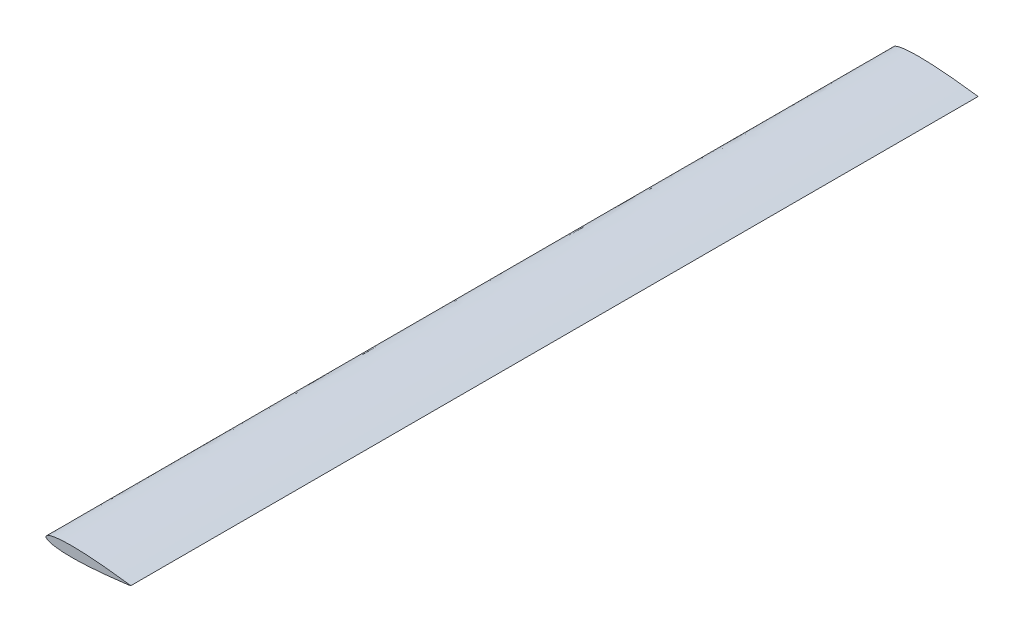
ISO-10303-21;
HEADER;
FILE_DESCRIPTION(('STEP AP214'),'2;1');
FILE_NAME('part.step','',(''),(''),'','','');
FILE_SCHEMA(('AUTOMOTIVE_DESIGN { 1 0 10303 214 1 1 1 1 }'));
ENDSEC;
DATA;
#1=APPLICATION_CONTEXT('core data for automotive mechanical design processes');
#2=APPLICATION_PROTOCOL_DEFINITION('international standard','automotive_design',2000,#1);
#3=PRODUCT_CONTEXT('',#1,'mechanical');
#4=PRODUCT('Part','Part','',(#3));
#5=PRODUCT_RELATED_PRODUCT_CATEGORY('part','',(#4));
#6=PRODUCT_DEFINITION_FORMATION('','',#4);
#7=PRODUCT_DEFINITION_CONTEXT('part definition',#1,'design');
#8=PRODUCT_DEFINITION('design','',#6,#7);
#9=PRODUCT_DEFINITION_SHAPE('','',#8);
#10=(LENGTH_UNIT() NAMED_UNIT(*) SI_UNIT(.MILLI.,.METRE.));
#11=(NAMED_UNIT(*) PLANE_ANGLE_UNIT() SI_UNIT($,.RADIAN.));
#12=(NAMED_UNIT(*) SI_UNIT($,.STERADIAN.) SOLID_ANGLE_UNIT());
#13=UNCERTAINTY_MEASURE_WITH_UNIT(LENGTH_MEASURE(1.E-05),#10,'distance_accuracy_value','');
#14=(GEOMETRIC_REPRESENTATION_CONTEXT(3) GLOBAL_UNCERTAINTY_ASSIGNED_CONTEXT((#13)) GLOBAL_UNIT_ASSIGNED_CONTEXT((#10,
#11,#12)) REPRESENTATION_CONTEXT('',''));
#15=CARTESIAN_POINT('',(0.,0.,0.));
#16=DIRECTION('',(0.,0.,1.));
#17=DIRECTION('',(1.,0.,0.));
#18=AXIS2_PLACEMENT_3D('',#15,#16,#17);
#19=CARTESIAN_POINT('',(0.,0.,10000.));
#20=CARTESIAN_POINT('',(-0.000792795405070369,-1.43720901794934,10000.));
#21=CARTESIAN_POINT('',(0.409444502492352,-4.38572469884501,10000.));
#22=CARTESIAN_POINT('',(2.25434713910245,-8.66028941048438,10000.));
#23=CARTESIAN_POINT('',(5.27074447818927,-12.7749518937072,10000.));
#24=CARTESIAN_POINT('',(9.42198257854812,-16.7475433871662,10000.));
#25=CARTESIAN_POINT('',(14.694615069678,-20.592001802784,10000.));
#26=CARTESIAN_POINT('',(21.0809596129229,-24.3119933407106,10000.));
#27=CARTESIAN_POINT('',(28.5716690543542,-27.9032902367736,10000.));
#28=CARTESIAN_POINT('',(37.1534631968142,-31.3577538271621,10000.));
#29=CARTESIAN_POINT('',(46.809318667321,-34.6651065414147,10000.));
#30=CARTESIAN_POINT('',(57.5186285304887,-37.8142745421539,10000.));
#31=CARTESIAN_POINT('',(69.2578261920979,-40.7934025621558,10000.));
#32=CARTESIAN_POINT('',(82.0002665891502,-43.5916843372624,10000.));
#33=CARTESIAN_POINT('',(95.7169555064091,-46.197637409165,10000.));
#34=CARTESIAN_POINT('',(110.376185726059,-48.601790331793,10000.));
#35=CARTESIAN_POINT('',(125.944126705451,-50.7942910336428,10000.));
#36=CARTESIAN_POINT('',(142.384569591742,-52.7677467681917,10000.));
#37=CARTESIAN_POINT('',(159.659307757944,-54.5151196644264,10000.));
#38=CARTESIAN_POINT('',(177.728060470773,-56.031551969668,10000.));
#39=CARTESIAN_POINT('',(196.548725497869,-57.3135357868012,10000.));
#40=CARTESIAN_POINT('',(216.077457601565,-58.358911955557,10000.));
#41=CARTESIAN_POINT('',(236.268658255214,-59.1678864812133,10000.));
#42=CARTESIAN_POINT('',(257.075184120231,-59.7419248488066,10000.));
#43=CARTESIAN_POINT('',(278.448476323679,-60.0840743315553,10000.));
#44=CARTESIAN_POINT('',(300.33866592988,-60.1994214936438,10000.));
#45=CARTESIAN_POINT('',(322.694622735347,-60.094113531422,10000.));
#46=CARTESIAN_POINT('',(345.464143189067,-59.7758146565333,10000.));
#47=CARTESIAN_POINT('',(368.594056668677,-59.2534604904865,10000.));
#48=CARTESIAN_POINT('',(392.030398993101,-58.5371931930983,10000.));
#49=CARTESIAN_POINT('',(415.71842585286,-57.6376330673979,10000.));
#50=CARTESIAN_POINT('',(439.602801494764,-56.5664908875375,10000.));
#51=CARTESIAN_POINT('',(463.627758769047,-55.3360431136563,10000.));
#52=CARTESIAN_POINT('',(487.737220494169,-53.9587882758612,10000.));
#53=CARTESIAN_POINT('',(511.87488318647,-52.4476138881414,10000.));
#54=CARTESIAN_POINT('',(535.984371375202,-50.8154517556381,10000.));
#55=CARTESIAN_POINT('',(560.009401700888,-49.0751900854433,10000.));
#56=CARTESIAN_POINT('',(583.893850790625,-47.2399418548301,10000.));
#57=CARTESIAN_POINT('',(607.581947996892,-45.3220450125794,10000.));
#58=CARTESIAN_POINT('',(631.018326919359,-43.3340828258684,10000.));
#59=CARTESIAN_POINT('',(654.148334193681,-41.2881522133876,10000.));
#60=CARTESIAN_POINT('',(676.917878388777,-39.1960613852951,10000.));
#61=CARTESIAN_POINT('',(699.27383310457,-37.0695918537327,10000.));
#62=CARTESIAN_POINT('',(721.163907940674,-34.919598689816,10000.));
#63=CARTESIAN_POINT('',(742.537076407175,-32.7572838564758,10000.));
#64=CARTESIAN_POINT('',(763.343326049556,-30.5931903526168,10000.));
#65=CARTESIAN_POINT('',(783.534112501466,-28.4379889821838,10000.));
#66=CARTESIAN_POINT('',(803.062234714203,-26.3021924537498,10000.));
#67=CARTESIAN_POINT('',(821.882065187473,-24.1953936026434,10000.));
#68=CARTESIAN_POINT('',(839.949720905107,-22.1283263387876,10000.));
#69=CARTESIAN_POINT('',(857.22296601622,-20.1106260619716,10000.));
#70=CARTESIAN_POINT('',(873.66145334122,-18.1522308617084,10000.));
#71=CARTESIAN_POINT('',(889.226740486499,-16.2628126143087,10000.));
#72=CARTESIAN_POINT('',(903.882537267435,-14.4523042324679,10000.));
#73=CARTESIAN_POINT('',(917.594569234184,-12.7298421068495,10000.));
#74=CARTESIAN_POINT('',(930.330846082998,-11.1051297885539,10000.));
#75=CARTESIAN_POINT('',(942.061526717181,-9.58639472895522,10000.));
#76=CARTESIAN_POINT('',(952.759379700056,-8.18339780379396,10000.));
#77=CARTESIAN_POINT('',(962.39909337424,-6.90239112392789,10000.));
#78=CARTESIAN_POINT('',(970.959106116575,-5.75556350979757,10000.));
#79=CARTESIAN_POINT('',(978.416539655893,-4.73704782658936,10000.));
#80=CARTESIAN_POINT('',(984.762543681692,-3.8910735599893,10000.));
#81=CARTESIAN_POINT('',(989.957865656706,-3.11547500184581,10000.));
#82=CARTESIAN_POINT('',(994.055890001684,-2.70308641650711,10000.));
#83=CARTESIAN_POINT('',(996.887787519083,-1.95719904266136,10000.));
#84=CARTESIAN_POINT('',(999.511557869285,-2.45214101406822,10000.));
#85=CARTESIAN_POINT('',(1000.48876725043,0.770740832716149,10000.));
#86=CARTESIAN_POINT('',(998.63732483532,0.784296204766219,10000.));
#87=CARTESIAN_POINT('',(996.976919865702,1.12960195222023,10000.));
#88=CARTESIAN_POINT('',(994.017909109704,1.48095984259178,10000.));
#89=CARTESIAN_POINT('',(989.9767430353,2.07317290877461,10000.));
#90=CARTESIAN_POINT('',(984.760381508977,2.78643866962468,10000.));
#91=CARTESIAN_POINT('',(978.423191435374,3.66389600305021,10000.));
#92=CARTESIAN_POINT('',(970.964194548596,4.6822725977774,10000.));
#93=CARTESIAN_POINT('',(962.406338582473,5.84129817826697,10000.));
#94=CARTESIAN_POINT('',(952.767760231741,7.13205690869354,10000.));
#95=CARTESIAN_POINT('',(942.071550495338,8.54713159362679,10000.));
#96=CARTESIAN_POINT('',(930.342525186815,10.0787225183276,10000.));
#97=CARTESIAN_POINT('',(917.608056829737,11.7175108151701,10000.));
#98=CARTESIAN_POINT('',(903.897931020654,13.4550918805866,10000.));
#99=CARTESIAN_POINT('',(889.244141323412,15.2817703439458,10000.));
#100=CARTESIAN_POINT('',(873.680947922206,17.1883590611535,10000.));
#101=CARTESIAN_POINT('',(857.244631249013,19.1648889050531,10000.));
#102=CARTESIAN_POINT('',(839.973622644905,21.201644478992,10000.));
#103=CARTESIAN_POINT('',(821.908258404754,23.2886435098918,10000.));
#104=CARTESIAN_POINT('',(803.090763693649,25.416203914468,10000.));
#105=CARTESIAN_POINT('',(783.56500966749,27.5735434022859,10000.));
#106=CARTESIAN_POINT('',(763.376613213151,29.7510187980997,10000.));
#107=CARTESIAN_POINT('',(742.572763753229,31.9380653276556,10000.));
#108=CARTESIAN_POINT('',(721.201993851847,34.1239586366864,10000.));
#109=CARTESIAN_POINT('',(699.31430430166,36.2981005569972,10000.));
#110=CARTESIAN_POINT('',(676.960709203026,38.4492328378259,10000.));
#111=CARTESIAN_POINT('',(654.193486948738,40.5664427256748,10000.));
#112=CARTESIAN_POINT('',(631.065750908671,42.6378901042562,10000.));
#113=CARTESIAN_POINT('',(607.631579453666,44.6517070946242,10000.));
#114=CARTESIAN_POINT('',(583.945612568972,46.5957364895256,10000.));
#115=CARTESIAN_POINT('',(560.063202738825,48.4573339468649,10000.));
#116=CARTESIAN_POINT('',(536.040106965058,50.2240999968117,10000.));
#117=CARTESIAN_POINT('',(511.932434119619,51.8828597523725,10000.));
#118=CARTESIAN_POINT('',(487.796453308912,53.4206629200941,10000.));
#119=CARTESIAN_POINT('',(463.688525702462,54.8245155068805,10000.));
#120=CARTESIAN_POINT('',(439.664940531602,56.0814678901787,10000.));
#121=CARTESIAN_POINT('',(415.781761154839,57.1789596807486,10000.));
#122=CARTESIAN_POINT('',(392.094741144082,58.1046529012218,10000.));
#123=CARTESIAN_POINT('',(368.659203299021,58.8467757358087,10000.));
#124=CARTESIAN_POINT('',(345.529880179047,59.3946474916847,10000.));
#125=CARTESIAN_POINT('',(322.760724743132,59.7380664796177,10000.));
#126=CARTESIAN_POINT('',(300.404897723122,59.8680384234365,10000.));
#127=CARTESIAN_POINT('',(278.514594182773,59.7768415229769,10000.));
#128=CARTESIAN_POINT('',(257.14093751261,59.4582721766071,10000.));
#129=CARTESIAN_POINT('',(236.333791006243,58.9071888057003,10000.));
#130=CARTESIAN_POINT('',(216.141710145178,58.1204905666712,10000.));
#131=CARTESIAN_POINT('',(196.611836622524,57.0966599648322,10000.));
#132=CARTESIAN_POINT('',(177.789768709904,55.8354406887898,10000.));
#133=CARTESIAN_POINT('',(159.719354000379,54.3389435255618,10000.));
#134=CARTESIAN_POINT('',(142.44269857075,52.6106299211488,10000.));
#135=CARTESIAN_POINT('',(126.000088489067,50.6553131858495,10000.));
#136=CARTESIAN_POINT('',(110.429738123545,48.4799890352125,10000.));
#137=CARTESIAN_POINT('',(95.7678644609862,46.09201026411,10000.));
#138=CARTESIAN_POINT('',(82.0483088926753,43.5011916147508,10000.));
#139=CARTESIAN_POINT('',(69.3027890664377,40.7169695466859,10000.));
#140=CARTESIAN_POINT('',(57.5603118478019,37.7507945235801,10000.));
#141=CARTESIAN_POINT('',(46.8475342054818,34.6134434070447,10000.));
#142=CARTESIAN_POINT('',(37.1880357985917,31.3167454574161,10000.));
#143=CARTESIAN_POINT('',(28.6024357671074,27.8717517708816,10000.));
#144=CARTESIAN_POINT('',(21.1077688123055,24.2887211307369,10000.));
#145=CARTESIAN_POINT('',(14.7173241021823,20.5757775445594,10000.));
#146=CARTESIAN_POINT('',(9.44045344922786,16.7371384617693,10000.));
#147=CARTESIAN_POINT('',(5.28483514271469,12.7691292089642,10000.));
#148=CARTESIAN_POINT('',(2.26390016806168,8.65779704809375,10000.));
#149=CARTESIAN_POINT('',(0.414282771983219,4.38527031316399,10000.));
#150=CARTESIAN_POINT('',(0.000792795405092487,1.43720901794941,10000.));
#151=CARTESIAN_POINT('',(0.,0.,10000.));
#152=B_SPLINE_CURVE_WITH_KNOTS('',3,(#19,#20,#21,#22,#23,#24,#25,#26,#27,#28,#29,#30,#31,#32,
#33,#34,#35,#36,#37,#38,#39,#40,#41,#42,#43,#44,#45,#46,#47,#48,#49,#50,#51,#52,#53,#54,#55,#56,
#57,#58,#59,#60,#61,#62,#63,#64,#65,#66,#67,#68,#69,#70,#71,#72,#73,#74,#75,#76,#77,#78,#79,#80,
#81,#82,#83,#84,#85,#86,#87,#88,#89,#90,#91,#92,#93,#94,#95,#96,#97,#98,#99,#100,#101,#102,#103,
#104,#105,#106,#107,#108,#109,#110,#111,#112,#113,#114,#115,#116,#117,#118,#119,#120,#121,#122,
#123,#124,#125,#126,#127,#128,#129,#130,#131,#132,#133,#134,#135,#136,#137,#138,#139,#140,#141,
#142,#143,#144,#145,#146,#147,#148,#149,#150,#151),.UNSPECIFIED.,.T.,.F.,(4,1,1,1,1,1,1,1,1,1,1,
1,1,1,1,1,1,1,1,1,1,1,1,1,1,1,1,1,1,1,1,1,1,1,1,1,1,1,1,1,1,1,1,1,1,1,1,1,1,1,1,1,1,1,1,1,1,1,1,
1,1,1,1,1,1,1,1,1,1,1,1,1,1,1,1,1,1,1,1,1,1,1,1,1,1,1,1,1,1,1,1,1,1,1,1,1,1,1,1,1,1,1,1,1,1,1,1,
1,1,1,1,1,1,1,1,1,1,1,1,1,1,1,1,1,1,1,1,1,1,1,4),(0.,0.00210662516508742,0.00432152779818795,
0.00677425311619007,0.00955877103083025,0.0127368049010756,0.0163464345052028,
0.0204100326990616,0.0249395135575642,0.0299395674092772,0.0354099237879132,0.0413464010576641,
0.0477419489806625,0.0545872336441876,0.0618708296618995,0.0695796682516994,0.0776991699138581,
0.0862133904959165,0.0951050764748118,0.104355887164511,0.113946424196437,0.123856213068997,
0.134063796675122,0.144546894541679,0.155282409334504,0.166246427968084,0.177414278035603,
0.188760778293845,0.200260099514594,0.211885925549039,0.223611508550097,0.235409731798431,
0.247253273619159,0.259114617784141,0.270966020055346,0.282779814246078,0.294528420629423,
0.306184124834711,0.317719709284655,0.329108027813105,0.340322353341088,0.351336231846437,
0.36212384671707,0.372659750515408,0.382919227977957,0.392877985897231,0.402512657128013,
0.411800467049624,0.420719531879002,0.42924881084479,0.43736807936973,0.445058129420091,
0.4523007149308,0.459078673228063,0.46537585264345,0.471177198584052,0.476468953226327,
0.481238379415884,0.485474105671914,0.48916592312608,0.492304968013908,0.494883645700075,
0.496895826204119,0.498336554193845,0.499202389581317,0.500508758617526,0.500797610418683,
0.501663445806155,0.503104173795881,0.505116354299925,0.507695031986092,0.51083407687392,
0.514525894328086,0.518761620584116,0.523531046773673,0.528822801415947,0.53462414735655,
0.540921326771937,0.5476992850692,0.554941870579909,0.56263192063027,0.57075118915521,
0.579280468120998,0.588199532950376,0.597487342871987,0.607122014102769,0.617080772022043,
0.627340249484592,0.63787615328293,0.648663768153563,0.659677646658912,0.670891972186894,
0.682280290715345,0.693815875165289,0.705471579370577,0.717220185753922,0.729033979944654,
0.740885382215858,0.752746726380841,0.764590268201568,0.776388491449903,0.788114074450961,
0.799739900485406,0.811239221706155,0.822585721964397,0.833753572031916,0.844717590665496,
0.855453105458321,0.865936203324877,0.876143786931003,0.886053575803563,0.895644112835489,
0.904894923525188,0.913786609504083,0.922300830086142,0.9304203317483,0.9381291703381,
0.945412766355812,0.952258051019337,0.958653598942335,0.964590076212086,0.970060432590723,
0.975060486442436,0.979589967300938,0.983653565494797,0.987263195098924,0.99044122896917,
0.99322574688381,0.995678472201812,0.997893374834912,1.),.UNSPECIFIED.);
#153=DIRECTION('',(0.,0.,-1.));
#154=VECTOR('',#153,1.);
#155=SURFACE_OF_LINEAR_EXTRUSION('',#152,#154);
#156=CARTESIAN_POINT('',(0.,0.,10000.));
#157=VERTEX_POINT('',#156);
#158=EDGE_CURVE('E10',#157,#157,#152,.T.);
#159=ORIENTED_EDGE('',*,*,#158,.F.);
#160=EDGE_LOOP('',(#159));
#161=FACE_BOUND('',#160,.T.);
#162=CARTESIAN_POINT('',(0.,0.,0.));
#163=CARTESIAN_POINT('',(-0.000792795405070369,-1.43720901794934,0.));
#164=CARTESIAN_POINT('',(0.409444502492352,-4.38572469884501,0.));
#165=CARTESIAN_POINT('',(2.25434713910245,-8.66028941048438,0.));
#166=CARTESIAN_POINT('',(5.27074447818927,-12.7749518937072,0.));
#167=CARTESIAN_POINT('',(9.42198257854812,-16.7475433871662,0.));
#168=CARTESIAN_POINT('',(14.694615069678,-20.592001802784,0.));
#169=CARTESIAN_POINT('',(21.0809596129229,-24.3119933407106,0.));
#170=CARTESIAN_POINT('',(28.5716690543542,-27.9032902367736,0.));
#171=CARTESIAN_POINT('',(37.1534631968142,-31.3577538271621,0.));
#172=CARTESIAN_POINT('',(46.809318667321,-34.6651065414147,0.));
#173=CARTESIAN_POINT('',(57.5186285304887,-37.8142745421539,0.));
#174=CARTESIAN_POINT('',(69.2578261920979,-40.7934025621558,0.));
#175=CARTESIAN_POINT('',(82.0002665891502,-43.5916843372624,0.));
#176=CARTESIAN_POINT('',(95.7169555064091,-46.197637409165,0.));
#177=CARTESIAN_POINT('',(110.376185726059,-48.601790331793,0.));
#178=CARTESIAN_POINT('',(125.944126705451,-50.7942910336428,0.));
#179=CARTESIAN_POINT('',(142.384569591742,-52.7677467681917,0.));
#180=CARTESIAN_POINT('',(159.659307757944,-54.5151196644264,0.));
#181=CARTESIAN_POINT('',(177.728060470773,-56.031551969668,0.));
#182=CARTESIAN_POINT('',(196.548725497869,-57.3135357868012,0.));
#183=CARTESIAN_POINT('',(216.077457601565,-58.358911955557,0.));
#184=CARTESIAN_POINT('',(236.268658255214,-59.1678864812133,0.));
#185=CARTESIAN_POINT('',(257.075184120231,-59.7419248488066,0.));
#186=CARTESIAN_POINT('',(278.448476323679,-60.0840743315553,0.));
#187=CARTESIAN_POINT('',(300.33866592988,-60.1994214936438,0.));
#188=CARTESIAN_POINT('',(322.694622735347,-60.094113531422,0.));
#189=CARTESIAN_POINT('',(345.464143189067,-59.7758146565333,0.));
#190=CARTESIAN_POINT('',(368.594056668677,-59.2534604904865,0.));
#191=CARTESIAN_POINT('',(392.030398993101,-58.5371931930983,0.));
#192=CARTESIAN_POINT('',(415.71842585286,-57.6376330673979,0.));
#193=CARTESIAN_POINT('',(439.602801494764,-56.5664908875375,0.));
#194=CARTESIAN_POINT('',(463.627758769047,-55.3360431136563,0.));
#195=CARTESIAN_POINT('',(487.737220494169,-53.9587882758612,0.));
#196=CARTESIAN_POINT('',(511.87488318647,-52.4476138881414,0.));
#197=CARTESIAN_POINT('',(535.984371375202,-50.8154517556381,0.));
#198=CARTESIAN_POINT('',(560.009401700888,-49.0751900854433,0.));
#199=CARTESIAN_POINT('',(583.893850790625,-47.2399418548301,0.));
#200=CARTESIAN_POINT('',(607.581947996892,-45.3220450125794,0.));
#201=CARTESIAN_POINT('',(631.018326919359,-43.3340828258684,0.));
#202=CARTESIAN_POINT('',(654.148334193681,-41.2881522133876,0.));
#203=CARTESIAN_POINT('',(676.917878388777,-39.1960613852951,0.));
#204=CARTESIAN_POINT('',(699.27383310457,-37.0695918537327,0.));
#205=CARTESIAN_POINT('',(721.163907940674,-34.919598689816,0.));
#206=CARTESIAN_POINT('',(742.537076407175,-32.7572838564758,0.));
#207=CARTESIAN_POINT('',(763.343326049556,-30.5931903526168,0.));
#208=CARTESIAN_POINT('',(783.534112501466,-28.4379889821838,0.));
#209=CARTESIAN_POINT('',(803.062234714203,-26.3021924537498,0.));
#210=CARTESIAN_POINT('',(821.882065187473,-24.1953936026434,0.));
#211=CARTESIAN_POINT('',(839.949720905107,-22.1283263387876,0.));
#212=CARTESIAN_POINT('',(857.22296601622,-20.1106260619716,0.));
#213=CARTESIAN_POINT('',(873.66145334122,-18.1522308617084,0.));
#214=CARTESIAN_POINT('',(889.226740486499,-16.2628126143087,0.));
#215=CARTESIAN_POINT('',(903.882537267435,-14.4523042324679,0.));
#216=CARTESIAN_POINT('',(917.594569234184,-12.7298421068495,0.));
#217=CARTESIAN_POINT('',(930.330846082998,-11.1051297885539,0.));
#218=CARTESIAN_POINT('',(942.061526717181,-9.58639472895522,0.));
#219=CARTESIAN_POINT('',(952.759379700056,-8.18339780379396,0.));
#220=CARTESIAN_POINT('',(962.39909337424,-6.90239112392789,0.));
#221=CARTESIAN_POINT('',(970.959106116575,-5.75556350979757,0.));
#222=CARTESIAN_POINT('',(978.416539655893,-4.73704782658936,0.));
#223=CARTESIAN_POINT('',(984.762543681692,-3.8910735599893,0.));
#224=CARTESIAN_POINT('',(989.957865656706,-3.11547500184581,0.));
#225=CARTESIAN_POINT('',(994.055890001684,-2.70308641650711,0.));
#226=CARTESIAN_POINT('',(996.887787519083,-1.95719904266136,0.));
#227=CARTESIAN_POINT('',(999.511557869285,-2.45214101406822,0.));
#228=CARTESIAN_POINT('',(1000.48876725043,0.770740832716149,0.));
#229=CARTESIAN_POINT('',(998.63732483532,0.784296204766219,0.));
#230=CARTESIAN_POINT('',(996.976919865702,1.12960195222023,0.));
#231=CARTESIAN_POINT('',(994.017909109704,1.48095984259178,0.));
#232=CARTESIAN_POINT('',(989.9767430353,2.07317290877461,0.));
#233=CARTESIAN_POINT('',(984.760381508977,2.78643866962468,0.));
#234=CARTESIAN_POINT('',(978.423191435374,3.66389600305021,0.));
#235=CARTESIAN_POINT('',(970.964194548596,4.6822725977774,0.));
#236=CARTESIAN_POINT('',(962.406338582473,5.84129817826697,0.));
#237=CARTESIAN_POINT('',(952.767760231741,7.13205690869354,0.));
#238=CARTESIAN_POINT('',(942.071550495338,8.54713159362679,0.));
#239=CARTESIAN_POINT('',(930.342525186815,10.0787225183276,0.));
#240=CARTESIAN_POINT('',(917.608056829737,11.7175108151701,0.));
#241=CARTESIAN_POINT('',(903.897931020654,13.4550918805866,0.));
#242=CARTESIAN_POINT('',(889.244141323412,15.2817703439458,0.));
#243=CARTESIAN_POINT('',(873.680947922206,17.1883590611535,0.));
#244=CARTESIAN_POINT('',(857.244631249013,19.1648889050531,0.));
#245=CARTESIAN_POINT('',(839.973622644905,21.201644478992,0.));
#246=CARTESIAN_POINT('',(821.908258404754,23.2886435098918,0.));
#247=CARTESIAN_POINT('',(803.090763693649,25.416203914468,0.));
#248=CARTESIAN_POINT('',(783.56500966749,27.5735434022859,0.));
#249=CARTESIAN_POINT('',(763.376613213151,29.7510187980997,0.));
#250=CARTESIAN_POINT('',(742.572763753229,31.9380653276556,0.));
#251=CARTESIAN_POINT('',(721.201993851847,34.1239586366864,0.));
#252=CARTESIAN_POINT('',(699.31430430166,36.2981005569972,0.));
#253=CARTESIAN_POINT('',(676.960709203026,38.4492328378259,0.));
#254=CARTESIAN_POINT('',(654.193486948738,40.5664427256748,0.));
#255=CARTESIAN_POINT('',(631.065750908671,42.6378901042562,0.));
#256=CARTESIAN_POINT('',(607.631579453666,44.6517070946242,0.));
#257=CARTESIAN_POINT('',(583.945612568972,46.5957364895256,0.));
#258=CARTESIAN_POINT('',(560.063202738825,48.4573339468649,0.));
#259=CARTESIAN_POINT('',(536.040106965058,50.2240999968117,0.));
#260=CARTESIAN_POINT('',(511.932434119619,51.8828597523725,0.));
#261=CARTESIAN_POINT('',(487.796453308912,53.4206629200941,0.));
#262=CARTESIAN_POINT('',(463.688525702462,54.8245155068805,0.));
#263=CARTESIAN_POINT('',(439.664940531602,56.0814678901787,0.));
#264=CARTESIAN_POINT('',(415.781761154839,57.1789596807486,0.));
#265=CARTESIAN_POINT('',(392.094741144082,58.1046529012218,0.));
#266=CARTESIAN_POINT('',(368.659203299021,58.8467757358087,0.));
#267=CARTESIAN_POINT('',(345.529880179047,59.3946474916847,0.));
#268=CARTESIAN_POINT('',(322.760724743132,59.7380664796177,0.));
#269=CARTESIAN_POINT('',(300.404897723122,59.8680384234365,0.));
#270=CARTESIAN_POINT('',(278.514594182773,59.7768415229769,0.));
#271=CARTESIAN_POINT('',(257.14093751261,59.4582721766071,0.));
#272=CARTESIAN_POINT('',(236.333791006243,58.9071888057003,0.));
#273=CARTESIAN_POINT('',(216.141710145178,58.1204905666712,0.));
#274=CARTESIAN_POINT('',(196.611836622524,57.0966599648322,0.));
#275=CARTESIAN_POINT('',(177.789768709904,55.8354406887898,0.));
#276=CARTESIAN_POINT('',(159.719354000379,54.3389435255618,0.));
#277=CARTESIAN_POINT('',(142.44269857075,52.6106299211488,0.));
#278=CARTESIAN_POINT('',(126.000088489067,50.6553131858495,0.));
#279=CARTESIAN_POINT('',(110.429738123545,48.4799890352125,0.));
#280=CARTESIAN_POINT('',(95.7678644609862,46.09201026411,0.));
#281=CARTESIAN_POINT('',(82.0483088926753,43.5011916147508,0.));
#282=CARTESIAN_POINT('',(69.3027890664377,40.7169695466859,0.));
#283=CARTESIAN_POINT('',(57.5603118478019,37.7507945235801,0.));
#284=CARTESIAN_POINT('',(46.8475342054818,34.6134434070447,0.));
#285=CARTESIAN_POINT('',(37.1880357985917,31.3167454574161,0.));
#286=CARTESIAN_POINT('',(28.6024357671074,27.8717517708816,0.));
#287=CARTESIAN_POINT('',(21.1077688123055,24.2887211307369,0.));
#288=CARTESIAN_POINT('',(14.7173241021823,20.5757775445594,0.));
#289=CARTESIAN_POINT('',(9.44045344922786,16.7371384617693,0.));
#290=CARTESIAN_POINT('',(5.28483514271469,12.7691292089642,0.));
#291=CARTESIAN_POINT('',(2.26390016806168,8.65779704809375,0.));
#292=CARTESIAN_POINT('',(0.414282771983219,4.38527031316399,0.));
#293=CARTESIAN_POINT('',(0.000792795405092487,1.43720901794941,0.));
#294=CARTESIAN_POINT('',(0.,0.,0.));
#295=B_SPLINE_CURVE_WITH_KNOTS('',3,(#162,#163,#164,#165,#166,#167,#168,#169,#170,#171,#172,
#173,#174,#175,#176,#177,#178,#179,#180,#181,#182,#183,#184,#185,#186,#187,#188,#189,#190,#191,
#192,#193,#194,#195,#196,#197,#198,#199,#200,#201,#202,#203,#204,#205,#206,#207,#208,#209,#210,
#211,#212,#213,#214,#215,#216,#217,#218,#219,#220,#221,#222,#223,#224,#225,#226,#227,#228,#229,
#230,#231,#232,#233,#234,#235,#236,#237,#238,#239,#240,#241,#242,#243,#244,#245,#246,#247,#248,
#249,#250,#251,#252,#253,#254,#255,#256,#257,#258,#259,#260,#261,#262,#263,#264,#265,#266,#267,
#268,#269,#270,#271,#272,#273,#274,#275,#276,#277,#278,#279,#280,#281,#282,#283,#284,#285,#286,
#287,#288,#289,#290,#291,#292,#293,#294),.UNSPECIFIED.,.T.,.F.,(4,1,1,1,1,1,1,1,1,1,1,1,1,1,1,1,
1,1,1,1,1,1,1,1,1,1,1,1,1,1,1,1,1,1,1,1,1,1,1,1,1,1,1,1,1,1,1,1,1,1,1,1,1,1,1,1,1,1,1,1,1,1,1,1,
1,1,1,1,1,1,1,1,1,1,1,1,1,1,1,1,1,1,1,1,1,1,1,1,1,1,1,1,1,1,1,1,1,1,1,1,1,1,1,1,1,1,1,1,1,1,1,1,
1,1,1,1,1,1,1,1,1,1,1,1,1,1,1,1,1,1,4),(0.,0.00210662516508742,0.00432152779818795,
0.00677425311619007,0.00955877103083025,0.0127368049010756,0.0163464345052028,
0.0204100326990616,0.0249395135575642,0.0299395674092772,0.0354099237879132,0.0413464010576641,
0.0477419489806625,0.0545872336441876,0.0618708296618995,0.0695796682516994,0.0776991699138581,
0.0862133904959165,0.0951050764748118,0.104355887164511,0.113946424196437,0.123856213068997,
0.134063796675122,0.144546894541679,0.155282409334504,0.166246427968084,0.177414278035603,
0.188760778293845,0.200260099514594,0.211885925549039,0.223611508550097,0.235409731798431,
0.247253273619159,0.259114617784141,0.270966020055346,0.282779814246078,0.294528420629423,
0.306184124834711,0.317719709284655,0.329108027813105,0.340322353341088,0.351336231846437,
0.36212384671707,0.372659750515408,0.382919227977957,0.392877985897231,0.402512657128013,
0.411800467049624,0.420719531879002,0.42924881084479,0.43736807936973,0.445058129420091,
0.4523007149308,0.459078673228063,0.46537585264345,0.471177198584052,0.476468953226327,
0.481238379415884,0.485474105671914,0.48916592312608,0.492304968013908,0.494883645700075,
0.496895826204119,0.498336554193845,0.499202389581317,0.500508758617526,0.500797610418683,
0.501663445806155,0.503104173795881,0.505116354299925,0.507695031986092,0.51083407687392,
0.514525894328086,0.518761620584116,0.523531046773673,0.528822801415947,0.53462414735655,
0.540921326771937,0.5476992850692,0.554941870579909,0.56263192063027,0.57075118915521,
0.579280468120998,0.588199532950376,0.597487342871987,0.607122014102769,0.617080772022043,
0.627340249484592,0.63787615328293,0.648663768153563,0.659677646658912,0.670891972186894,
0.682280290715345,0.693815875165289,0.705471579370577,0.717220185753922,0.729033979944654,
0.740885382215858,0.752746726380841,0.764590268201568,0.776388491449903,0.788114074450961,
0.799739900485406,0.811239221706155,0.822585721964397,0.833753572031916,0.844717590665496,
0.855453105458321,0.865936203324877,0.876143786931003,0.886053575803563,0.895644112835489,
0.904894923525188,0.913786609504083,0.922300830086142,0.9304203317483,0.9381291703381,
0.945412766355812,0.952258051019337,0.958653598942335,0.964590076212086,0.970060432590723,
0.975060486442436,0.979589967300938,0.983653565494797,0.987263195098924,0.99044122896917,
0.99322574688381,0.995678472201812,0.997893374834912,1.),.UNSPECIFIED.);
#296=CARTESIAN_POINT('',(0.,0.,0.));
#297=VERTEX_POINT('',#296);
#298=EDGE_CURVE('E34',#297,#297,#295,.T.);
#299=ORIENTED_EDGE('',*,*,#298,.T.);
#300=EDGE_LOOP('',(#299));
#301=FACE_BOUND('',#300,.T.);
#302=ADVANCED_FACE('F30',(#161,#301),#155,.F.);
#303=CARTESIAN_POINT('',(999.991618848287,-0.145902840098966,10000.));
#304=DIRECTION('',(0.,0.,-1.));
#305=DIRECTION('',(-1.,0.,0.));
#306=AXIS2_PLACEMENT_3D('',#303,#304,#305);
#307=PLANE('',#306);
#308=ORIENTED_EDGE('',*,*,#158,.T.);
#309=EDGE_LOOP('',(#308));
#310=FACE_BOUND('',#309,.T.);
#311=ADVANCED_FACE('F53',(#310),#307,.F.);
#312=CARTESIAN_POINT('',(999.991618848287,-0.145902840098966,0.));
#313=DIRECTION('',(0.,0.,-1.));
#314=DIRECTION('',(-1.,0.,0.));
#315=AXIS2_PLACEMENT_3D('',#312,#313,#314);
#316=PLANE('',#315);
#317=ORIENTED_EDGE('',*,*,#298,.F.);
#318=EDGE_LOOP('',(#317));
#319=FACE_BOUND('',#318,.T.);
#320=ADVANCED_FACE('F51',(#319),#316,.T.);
#321=CLOSED_SHELL('',(#302,#311,#320));
#322=MANIFOLD_SOLID_BREP('B2',#321);
#323=ADVANCED_BREP_SHAPE_REPRESENTATION('',(#18,#322),#14);
#324=SHAPE_DEFINITION_REPRESENTATION(#9,#323);
ENDSEC;
END-ISO-10303-21;
